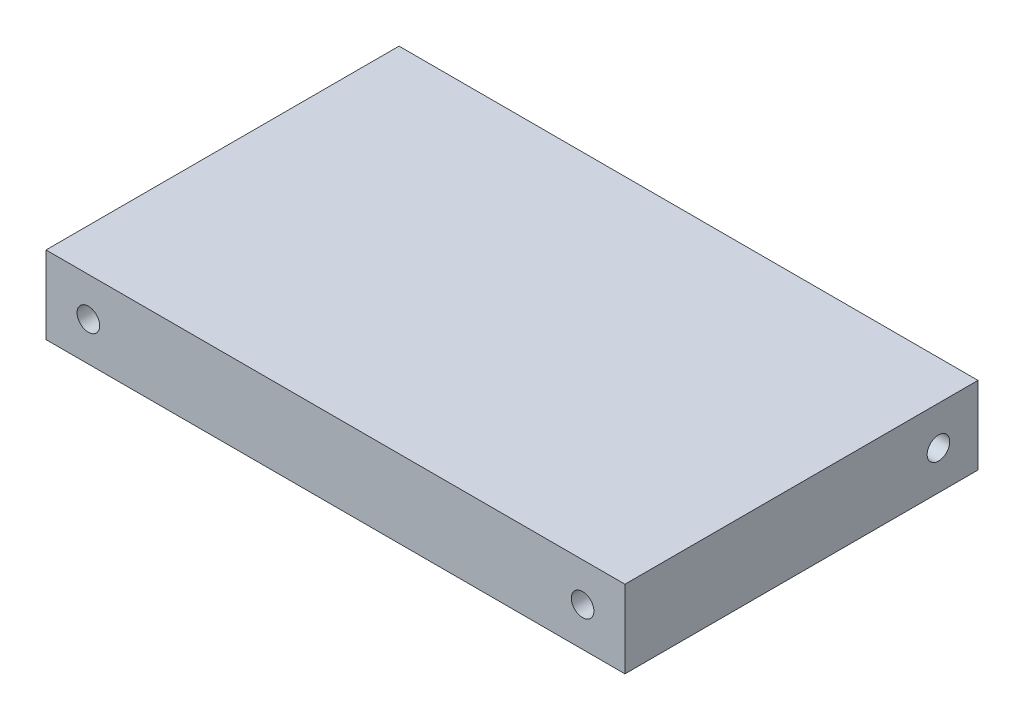
ISO-10303-21;
HEADER;
FILE_DESCRIPTION(('STEP AP214'),'2;1');
FILE_NAME('part.step','',(''),(''),'','','');
FILE_SCHEMA(('AUTOMOTIVE_DESIGN { 1 0 10303 214 1 1 1 1 }'));
ENDSEC;
DATA;
#1=APPLICATION_CONTEXT('core data for automotive mechanical design processes');
#2=APPLICATION_PROTOCOL_DEFINITION('international standard','automotive_design',2000,#1);
#3=PRODUCT_CONTEXT('',#1,'mechanical');
#4=PRODUCT('Part','Part','',(#3));
#5=PRODUCT_RELATED_PRODUCT_CATEGORY('part','',(#4));
#6=PRODUCT_DEFINITION_FORMATION('','',#4);
#7=PRODUCT_DEFINITION_CONTEXT('part definition',#1,'design');
#8=PRODUCT_DEFINITION('design','',#6,#7);
#9=PRODUCT_DEFINITION_SHAPE('','',#8);
#10=(LENGTH_UNIT() NAMED_UNIT(*) SI_UNIT(.MILLI.,.METRE.));
#11=(NAMED_UNIT(*) PLANE_ANGLE_UNIT() SI_UNIT($,.RADIAN.));
#12=(NAMED_UNIT(*) SI_UNIT($,.STERADIAN.) SOLID_ANGLE_UNIT());
#13=UNCERTAINTY_MEASURE_WITH_UNIT(LENGTH_MEASURE(1.E-05),#10,'distance_accuracy_value','');
#14=(GEOMETRIC_REPRESENTATION_CONTEXT(3) GLOBAL_UNCERTAINTY_ASSIGNED_CONTEXT((#13)) GLOBAL_UNIT_ASSIGNED_CONTEXT((#10,
#11,#12)) REPRESENTATION_CONTEXT('',''));
#15=CARTESIAN_POINT('',(0.,0.,0.));
#16=DIRECTION('',(0.,0.,1.));
#17=DIRECTION('',(1.,0.,0.));
#18=AXIS2_PLACEMENT_3D('',#15,#16,#17);
#19=CARTESIAN_POINT('',(0.,0.,50.));
#20=DIRECTION('',(-1.,0.,0.));
#21=DIRECTION('',(0.,0.,1.));
#22=AXIS2_PLACEMENT_3D('',#19,#20,#21);
#23=PLANE('',#22);
#24=CARTESIAN_POINT('',(0.,5.5,5.6));
#25=DIRECTION('',(1.,0.,0.));
#26=DIRECTION('',(0.,0.,-1.));
#27=AXIS2_PLACEMENT_3D('',#24,#25,#26);
#28=CIRCLE('',#27,1.6);
#29=CARTESIAN_POINT('',(0.,5.5,4.));
#30=VERTEX_POINT('',#29);
#31=EDGE_CURVE('E128',#30,#30,#28,.T.);
#32=ORIENTED_EDGE('',*,*,#31,.F.);
#33=EDGE_LOOP('',(#32));
#34=FACE_BOUND('',#33,.T.);
#35=DIRECTION('',(0.,1.,0.));
#36=VECTOR('',#35,1.);
#37=CARTESIAN_POINT('',(0.,0.,0.));
#38=LINE('',#37,#36);
#39=CARTESIAN_POINT('',(0.,0.,0.));
#40=VERTEX_POINT('',#39);
#41=CARTESIAN_POINT('',(0.,11.,0.));
#42=VERTEX_POINT('',#41);
#43=EDGE_CURVE('E107',#40,#42,#38,.T.);
#44=ORIENTED_EDGE('',*,*,#43,.T.);
#45=DIRECTION('',(0.,0.,-1.));
#46=VECTOR('',#45,1.);
#47=CARTESIAN_POINT('',(0.,11.,50.));
#48=LINE('',#47,#46);
#49=CARTESIAN_POINT('',(0.,11.,50.));
#50=VERTEX_POINT('',#49);
#51=EDGE_CURVE('E11',#50,#42,#48,.T.);
#52=ORIENTED_EDGE('',*,*,#51,.F.);
#53=DIRECTION('',(0.,1.,0.));
#54=VECTOR('',#53,1.);
#55=CARTESIAN_POINT('',(0.,0.,50.));
#56=LINE('',#55,#54);
#57=CARTESIAN_POINT('',(0.,0.,50.));
#58=VERTEX_POINT('',#57);
#59=EDGE_CURVE('E91',#58,#50,#56,.T.);
#60=ORIENTED_EDGE('',*,*,#59,.F.);
#61=DIRECTION('',(0.,0.,-1.));
#62=VECTOR('',#61,1.);
#63=CARTESIAN_POINT('',(0.,0.,50.));
#64=LINE('',#63,#62);
#65=EDGE_CURVE('E103',#58,#40,#64,.T.);
#66=ORIENTED_EDGE('',*,*,#65,.T.);
#67=EDGE_LOOP('',(#44,#52,#60,#66));
#68=FACE_BOUND('',#67,.T.);
#69=ADVANCED_FACE('F39',(#34,#68),#23,.F.);
#70=CARTESIAN_POINT('',(0.,11.,50.));
#71=DIRECTION('',(0.,-1.,0.));
#72=DIRECTION('',(1.,0.,0.));
#73=AXIS2_PLACEMENT_3D('',#70,#71,#72);
#74=PLANE('',#73);
#75=DIRECTION('',(-1.,0.,0.));
#76=VECTOR('',#75,1.);
#77=CARTESIAN_POINT('',(0.,11.,0.));
#78=LINE('',#77,#76);
#79=CARTESIAN_POINT('',(-82.,11.,0.));
#80=VERTEX_POINT('',#79);
#81=EDGE_CURVE('E96',#42,#80,#78,.T.);
#82=ORIENTED_EDGE('',*,*,#81,.T.);
#83=DIRECTION('',(0.,0.,-1.));
#84=VECTOR('',#83,1.);
#85=CARTESIAN_POINT('',(-82.,11.,50.));
#86=LINE('',#85,#84);
#87=CARTESIAN_POINT('',(-82.,11.,50.));
#88=VERTEX_POINT('',#87);
#89=EDGE_CURVE('E48',#88,#80,#86,.T.);
#90=ORIENTED_EDGE('',*,*,#89,.F.);
#91=DIRECTION('',(-1.,0.,0.));
#92=VECTOR('',#91,1.);
#93=CARTESIAN_POINT('',(0.,11.,50.));
#94=LINE('',#93,#92);
#95=EDGE_CURVE('E86',#50,#88,#94,.T.);
#96=ORIENTED_EDGE('',*,*,#95,.F.);
#97=ORIENTED_EDGE('',*,*,#51,.T.);
#98=EDGE_LOOP('',(#82,#90,#96,#97));
#99=FACE_BOUND('',#98,.T.);
#100=ADVANCED_FACE('F95',(#99),#74,.F.);
#101=CARTESIAN_POINT('',(-82.,0.,50.));
#102=DIRECTION('',(1.,0.,0.));
#103=DIRECTION('',(0.,0.,-1.));
#104=AXIS2_PLACEMENT_3D('',#101,#102,#103);
#105=PLANE('',#104);
#106=CARTESIAN_POINT('',(-82.,5.49999999999999,5.6));
#107=DIRECTION('',(-1.,0.,0.));
#108=DIRECTION('',(0.,0.,1.));
#109=AXIS2_PLACEMENT_3D('',#106,#107,#108);
#110=CIRCLE('',#109,1.6);
#111=CARTESIAN_POINT('',(-82.,5.49999999999999,7.2));
#112=VERTEX_POINT('',#111);
#113=EDGE_CURVE('E136',#112,#112,#110,.T.);
#114=ORIENTED_EDGE('',*,*,#113,.F.);
#115=EDGE_LOOP('',(#114));
#116=FACE_BOUND('',#115,.T.);
#117=DIRECTION('',(0.,-1.,0.));
#118=VECTOR('',#117,1.);
#119=CARTESIAN_POINT('',(-82.,0.,0.));
#120=LINE('',#119,#118);
#121=CARTESIAN_POINT('',(-82.,0.,0.));
#122=VERTEX_POINT('',#121);
#123=EDGE_CURVE('E73',#80,#122,#120,.T.);
#124=ORIENTED_EDGE('',*,*,#123,.T.);
#125=DIRECTION('',(0.,0.,-1.));
#126=VECTOR('',#125,1.);
#127=CARTESIAN_POINT('',(-82.,0.,50.));
#128=LINE('',#127,#126);
#129=CARTESIAN_POINT('',(-82.,0.,50.));
#130=VERTEX_POINT('',#129);
#131=EDGE_CURVE('E98',#130,#122,#128,.T.);
#132=ORIENTED_EDGE('',*,*,#131,.F.);
#133=DIRECTION('',(0.,-1.,0.));
#134=VECTOR('',#133,1.);
#135=CARTESIAN_POINT('',(-82.,0.,50.));
#136=LINE('',#135,#134);
#137=EDGE_CURVE('E89',#88,#130,#136,.T.);
#138=ORIENTED_EDGE('',*,*,#137,.F.);
#139=ORIENTED_EDGE('',*,*,#89,.T.);
#140=EDGE_LOOP('',(#124,#132,#138,#139));
#141=FACE_BOUND('',#140,.T.);
#142=ADVANCED_FACE('F99',(#116,#141),#105,.F.);
#143=CARTESIAN_POINT('',(0.,0.,50.));
#144=DIRECTION('',(0.,1.,0.));
#145=DIRECTION('',(-1.,0.,0.));
#146=AXIS2_PLACEMENT_3D('',#143,#144,#145);
#147=PLANE('',#146);
#148=DIRECTION('',(1.,0.,0.));
#149=VECTOR('',#148,1.);
#150=CARTESIAN_POINT('',(0.,0.,0.));
#151=LINE('',#150,#149);
#152=EDGE_CURVE('E79',#122,#40,#151,.T.);
#153=ORIENTED_EDGE('',*,*,#152,.T.);
#154=ORIENTED_EDGE('',*,*,#65,.F.);
#155=DIRECTION('',(1.,0.,0.));
#156=VECTOR('',#155,1.);
#157=CARTESIAN_POINT('',(0.,0.,50.));
#158=LINE('',#157,#156);
#159=EDGE_CURVE('E56',#130,#58,#158,.T.);
#160=ORIENTED_EDGE('',*,*,#159,.F.);
#161=ORIENTED_EDGE('',*,*,#131,.T.);
#162=EDGE_LOOP('',(#153,#154,#160,#161));
#163=FACE_BOUND('',#162,.T.);
#164=ADVANCED_FACE('F121',(#163),#147,.F.);
#165=CARTESIAN_POINT('',(0.,0.,50.));
#166=DIRECTION('',(0.,0.,1.));
#167=DIRECTION('',(1.,0.,0.));
#168=AXIS2_PLACEMENT_3D('',#165,#166,#167);
#169=PLANE('',#168);
#170=CARTESIAN_POINT('',(-76.,5.5,50.));
#171=DIRECTION('',(0.,0.,1.));
#172=DIRECTION('',(1.,0.,0.));
#173=AXIS2_PLACEMENT_3D('',#170,#171,#172);
#174=CIRCLE('',#173,1.60000000000001);
#175=CARTESIAN_POINT('',(-74.4,5.5,50.));
#176=VERTEX_POINT('',#175);
#177=EDGE_CURVE('E152',#176,#176,#174,.T.);
#178=ORIENTED_EDGE('',*,*,#177,.F.);
#179=EDGE_LOOP('',(#178));
#180=FACE_BOUND('',#179,.T.);
#181=CARTESIAN_POINT('',(-6.,5.5,50.));
#182=DIRECTION('',(0.,0.,1.));
#183=DIRECTION('',(1.,0.,0.));
#184=AXIS2_PLACEMENT_3D('',#181,#182,#183);
#185=CIRCLE('',#184,1.6);
#186=CARTESIAN_POINT('',(-4.4,5.5,50.));
#187=VERTEX_POINT('',#186);
#188=EDGE_CURVE('E144',#187,#187,#185,.T.);
#189=ORIENTED_EDGE('',*,*,#188,.F.);
#190=EDGE_LOOP('',(#189));
#191=FACE_BOUND('',#190,.T.);
#192=ORIENTED_EDGE('',*,*,#59,.T.);
#193=ORIENTED_EDGE('',*,*,#95,.T.);
#194=ORIENTED_EDGE('',*,*,#137,.T.);
#195=ORIENTED_EDGE('',*,*,#159,.T.);
#196=EDGE_LOOP('',(#192,#193,#194,#195));
#197=FACE_BOUND('',#196,.T.);
#198=ADVANCED_FACE('F87',(#180,#191,#197),#169,.T.);
#199=CARTESIAN_POINT('',(0.,0.,0.));
#200=DIRECTION('',(0.,0.,1.));
#201=DIRECTION('',(1.,0.,0.));
#202=AXIS2_PLACEMENT_3D('',#199,#200,#201);
#203=PLANE('',#202);
#204=ORIENTED_EDGE('',*,*,#43,.F.);
#205=ORIENTED_EDGE('',*,*,#152,.F.);
#206=ORIENTED_EDGE('',*,*,#123,.F.);
#207=ORIENTED_EDGE('',*,*,#81,.F.);
#208=EDGE_LOOP('',(#204,#205,#206,#207));
#209=FACE_BOUND('',#208,.T.);
#210=ADVANCED_FACE('F124',(#209),#203,.F.);
#211=CARTESIAN_POINT('',(-10.,5.5,5.6));
#212=DIRECTION('',(1.,0.,0.));
#213=DIRECTION('',(0.,0.,-1.));
#214=AXIS2_PLACEMENT_3D('',#211,#212,#213);
#215=CYLINDRICAL_SURFACE('',#214,1.6);
#216=CARTESIAN_POINT('',(-10.,5.5,5.6));
#217=DIRECTION('',(1.,0.,0.));
#218=DIRECTION('',(0.,0.,-1.));
#219=AXIS2_PLACEMENT_3D('',#216,#217,#218);
#220=CIRCLE('',#219,1.6);
#221=CARTESIAN_POINT('',(-10.,5.5,4.));
#222=VERTEX_POINT('',#221);
#223=EDGE_CURVE('E111',#222,#222,#220,.T.);
#224=ORIENTED_EDGE('',*,*,#223,.F.);
#225=EDGE_LOOP('',(#224));
#226=FACE_BOUND('',#225,.T.);
#227=ORIENTED_EDGE('',*,*,#31,.T.);
#228=EDGE_LOOP('',(#227));
#229=FACE_BOUND('',#228,.T.);
#230=ADVANCED_FACE('F196',(#226,#229),#215,.F.);
#231=CARTESIAN_POINT('',(-10.,5.5,5.6));
#232=DIRECTION('',(1.,0.,0.));
#233=DIRECTION('',(0.,0.,-1.));
#234=AXIS2_PLACEMENT_3D('',#231,#232,#233);
#235=PLANE('',#234);
#236=ORIENTED_EDGE('',*,*,#223,.T.);
#237=EDGE_LOOP('',(#236));
#238=FACE_BOUND('',#237,.T.);
#239=ADVANCED_FACE('F198',(#238),#235,.T.);
#240=CARTESIAN_POINT('',(-72.,5.49999999999999,5.6));
#241=DIRECTION('',(-1.,0.,0.));
#242=DIRECTION('',(0.,0.,1.));
#243=AXIS2_PLACEMENT_3D('',#240,#241,#242);
#244=CYLINDRICAL_SURFACE('',#243,1.6);
#245=CARTESIAN_POINT('',(-72.,5.49999999999999,5.6));
#246=DIRECTION('',(-1.,0.,0.));
#247=DIRECTION('',(0.,0.,1.));
#248=AXIS2_PLACEMENT_3D('',#245,#246,#247);
#249=CIRCLE('',#248,1.6);
#250=CARTESIAN_POINT('',(-72.,5.49999999999999,7.2));
#251=VERTEX_POINT('',#250);
#252=EDGE_CURVE('E132',#251,#251,#249,.T.);
#253=ORIENTED_EDGE('',*,*,#252,.F.);
#254=EDGE_LOOP('',(#253));
#255=FACE_BOUND('',#254,.T.);
#256=ORIENTED_EDGE('',*,*,#113,.T.);
#257=EDGE_LOOP('',(#256));
#258=FACE_BOUND('',#257,.T.);
#259=ADVANCED_FACE('F185',(#255,#258),#244,.F.);
#260=CARTESIAN_POINT('',(-72.,5.49999999999999,5.6));
#261=DIRECTION('',(-1.,0.,0.));
#262=DIRECTION('',(0.,0.,1.));
#263=AXIS2_PLACEMENT_3D('',#260,#261,#262);
#264=PLANE('',#263);
#265=ORIENTED_EDGE('',*,*,#252,.T.);
#266=EDGE_LOOP('',(#265));
#267=FACE_BOUND('',#266,.T.);
#268=ADVANCED_FACE('F176',(#267),#264,.T.);
#269=CARTESIAN_POINT('',(-6.,5.5,35.));
#270=DIRECTION('',(0.,0.,1.));
#271=DIRECTION('',(1.,0.,0.));
#272=AXIS2_PLACEMENT_3D('',#269,#270,#271);
#273=CYLINDRICAL_SURFACE('',#272,1.6);
#274=CARTESIAN_POINT('',(-6.,5.5,35.));
#275=DIRECTION('',(0.,0.,1.));
#276=DIRECTION('',(1.,0.,0.));
#277=AXIS2_PLACEMENT_3D('',#274,#275,#276);
#278=CIRCLE('',#277,1.6);
#279=CARTESIAN_POINT('',(-4.4,5.5,35.));
#280=VERTEX_POINT('',#279);
#281=EDGE_CURVE('E148',#280,#280,#278,.T.);
#282=ORIENTED_EDGE('',*,*,#281,.F.);
#283=EDGE_LOOP('',(#282));
#284=FACE_BOUND('',#283,.T.);
#285=ORIENTED_EDGE('',*,*,#188,.T.);
#286=EDGE_LOOP('',(#285));
#287=FACE_BOUND('',#286,.T.);
#288=ADVANCED_FACE('F174',(#284,#287),#273,.F.);
#289=CARTESIAN_POINT('',(-6.,5.5,35.));
#290=DIRECTION('',(0.,0.,1.));
#291=DIRECTION('',(1.,0.,0.));
#292=AXIS2_PLACEMENT_3D('',#289,#290,#291);
#293=PLANE('',#292);
#294=ORIENTED_EDGE('',*,*,#281,.T.);
#295=EDGE_LOOP('',(#294));
#296=FACE_BOUND('',#295,.T.);
#297=ADVANCED_FACE('F165',(#296),#293,.T.);
#298=CARTESIAN_POINT('',(-76.,5.5,35.));
#299=DIRECTION('',(0.,0.,1.));
#300=DIRECTION('',(1.,0.,0.));
#301=AXIS2_PLACEMENT_3D('',#298,#299,#300);
#302=CYLINDRICAL_SURFACE('',#301,1.60000000000001);
#303=CARTESIAN_POINT('',(-76.,5.5,35.));
#304=DIRECTION('',(0.,0.,1.));
#305=DIRECTION('',(1.,0.,0.));
#306=AXIS2_PLACEMENT_3D('',#303,#304,#305);
#307=CIRCLE('',#306,1.60000000000001);
#308=CARTESIAN_POINT('',(-74.4,5.5,35.));
#309=VERTEX_POINT('',#308);
#310=EDGE_CURVE('E140',#309,#309,#307,.T.);
#311=ORIENTED_EDGE('',*,*,#310,.F.);
#312=EDGE_LOOP('',(#311));
#313=FACE_BOUND('',#312,.T.);
#314=ORIENTED_EDGE('',*,*,#177,.T.);
#315=EDGE_LOOP('',(#314));
#316=FACE_BOUND('',#315,.T.);
#317=ADVANCED_FACE('F162',(#313,#316),#302,.F.);
#318=CARTESIAN_POINT('',(-76.,5.5,35.));
#319=DIRECTION('',(0.,0.,1.));
#320=DIRECTION('',(1.,0.,0.));
#321=AXIS2_PLACEMENT_3D('',#318,#319,#320);
#322=PLANE('',#321);
#323=ORIENTED_EDGE('',*,*,#310,.T.);
#324=EDGE_LOOP('',(#323));
#325=FACE_BOUND('',#324,.T.);
#326=ADVANCED_FACE('F160',(#325),#322,.T.);
#327=CLOSED_SHELL('',(#69,#100,#142,#164,#198,#210,#230,#239,#259,#268,#288,#297,#317,#326));
#328=MANIFOLD_SOLID_BREP('B2',#327);
#329=ADVANCED_BREP_SHAPE_REPRESENTATION('',(#18,#328),#14);
#330=SHAPE_DEFINITION_REPRESENTATION(#9,#329);
ENDSEC;
END-ISO-10303-21;
